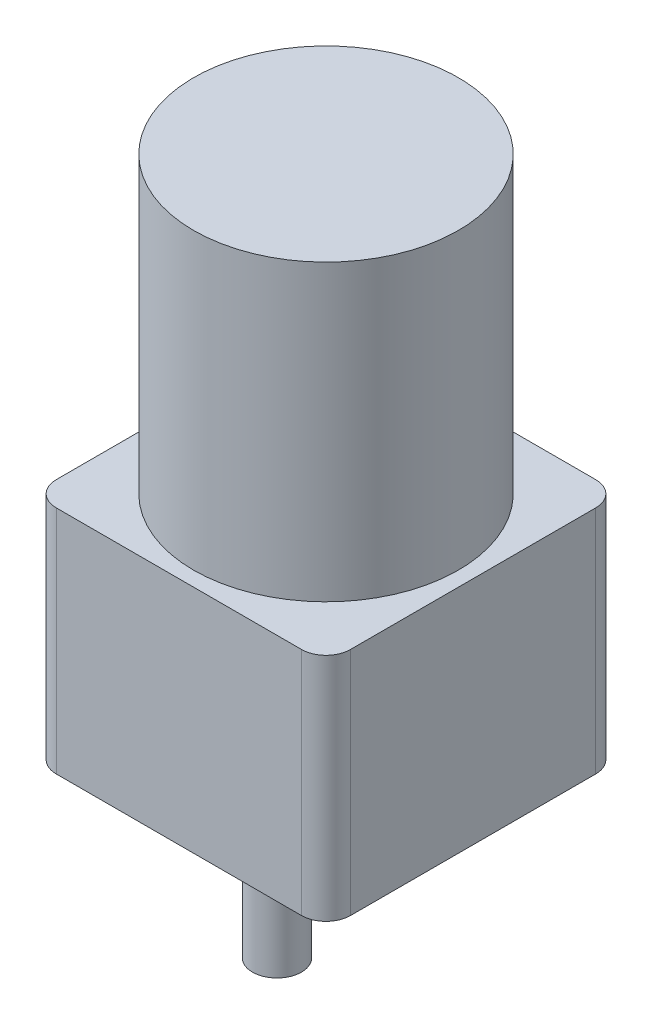
ISO-10303-21;
HEADER;
FILE_DESCRIPTION(('STEP AP214'),'2;1');
FILE_NAME('part.step','',(''),(''),'','','');
FILE_SCHEMA(('AUTOMOTIVE_DESIGN { 1 0 10303 214 1 1 1 1 }'));
ENDSEC;
DATA;
#1=APPLICATION_CONTEXT('core data for automotive mechanical design processes');
#2=APPLICATION_PROTOCOL_DEFINITION('international standard','automotive_design',2000,#1);
#3=PRODUCT_CONTEXT('',#1,'mechanical');
#4=PRODUCT('Part','Part','',(#3));
#5=PRODUCT_RELATED_PRODUCT_CATEGORY('part','',(#4));
#6=PRODUCT_DEFINITION_FORMATION('','',#4);
#7=PRODUCT_DEFINITION_CONTEXT('part definition',#1,'design');
#8=PRODUCT_DEFINITION('design','',#6,#7);
#9=PRODUCT_DEFINITION_SHAPE('','',#8);
#10=(LENGTH_UNIT() NAMED_UNIT(*) SI_UNIT(.MILLI.,.METRE.));
#11=(NAMED_UNIT(*) PLANE_ANGLE_UNIT() SI_UNIT($,.RADIAN.));
#12=(NAMED_UNIT(*) SI_UNIT($,.STERADIAN.) SOLID_ANGLE_UNIT());
#13=UNCERTAINTY_MEASURE_WITH_UNIT(LENGTH_MEASURE(1.E-05),#10,'distance_accuracy_value','');
#14=(GEOMETRIC_REPRESENTATION_CONTEXT(3) GLOBAL_UNCERTAINTY_ASSIGNED_CONTEXT((#13)) GLOBAL_UNIT_ASSIGNED_CONTEXT((#10,
#11,#12)) REPRESENTATION_CONTEXT('',''));
#15=CARTESIAN_POINT('',(0.,0.,0.));
#16=DIRECTION('',(0.,0.,1.));
#17=DIRECTION('',(1.,0.,0.));
#18=AXIS2_PLACEMENT_3D('',#15,#16,#17);
#19=CARTESIAN_POINT('',(30.,47.,-30.));
#20=DIRECTION('',(-1.,0.,0.));
#21=DIRECTION('',(0.,0.,1.));
#22=AXIS2_PLACEMENT_3D('',#19,#20,#21);
#23=PLANE('',#22);
#24=DIRECTION('',(0.,0.,-1.));
#25=VECTOR('',#24,1.);
#26=CARTESIAN_POINT('',(30.,0.,-30.));
#27=LINE('',#26,#25);
#28=CARTESIAN_POINT('',(30.,0.,25.));
#29=VERTEX_POINT('',#28);
#30=CARTESIAN_POINT('',(30.,0.,-25.));
#31=VERTEX_POINT('',#30);
#32=EDGE_CURVE('E145',#29,#31,#27,.T.);
#33=ORIENTED_EDGE('',*,*,#32,.T.);
#34=DIRECTION('',(0.,-1.,0.));
#35=VECTOR('',#34,1.);
#36=CARTESIAN_POINT('',(30.,47.,-25.));
#37=LINE('',#36,#35);
#38=CARTESIAN_POINT('',(30.,47.,-25.));
#39=VERTEX_POINT('',#38);
#40=EDGE_CURVE('E179',#31,#39,#37,.F.);
#41=ORIENTED_EDGE('',*,*,#40,.T.);
#42=DIRECTION('',(0.,0.,-1.));
#43=VECTOR('',#42,1.);
#44=CARTESIAN_POINT('',(30.,47.,-30.));
#45=LINE('',#44,#43);
#46=CARTESIAN_POINT('',(30.,47.,25.));
#47=VERTEX_POINT('',#46);
#48=EDGE_CURVE('E143',#47,#39,#45,.T.);
#49=ORIENTED_EDGE('',*,*,#48,.F.);
#50=DIRECTION('',(0.,-1.,0.));
#51=VECTOR('',#50,1.);
#52=CARTESIAN_POINT('',(30.,47.,25.));
#53=LINE('',#52,#51);
#54=EDGE_CURVE('E175',#47,#29,#53,.T.);
#55=ORIENTED_EDGE('',*,*,#54,.T.);
#56=EDGE_LOOP('',(#33,#41,#49,#55));
#57=FACE_BOUND('',#56,.T.);
#58=ADVANCED_FACE('F42',(#57),#23,.F.);
#59=CARTESIAN_POINT('',(-30.,47.,-30.));
#60=DIRECTION('',(0.,0.,1.));
#61=DIRECTION('',(1.,0.,0.));
#62=AXIS2_PLACEMENT_3D('',#59,#60,#61);
#63=PLANE('',#62);
#64=DIRECTION('',(-1.,0.,0.));
#65=VECTOR('',#64,1.);
#66=CARTESIAN_POINT('',(-30.,0.,-30.));
#67=LINE('',#66,#65);
#68=CARTESIAN_POINT('',(25.,0.,-30.));
#69=VERTEX_POINT('',#68);
#70=CARTESIAN_POINT('',(-25.,0.,-30.));
#71=VERTEX_POINT('',#70);
#72=EDGE_CURVE('E139',#69,#71,#67,.T.);
#73=ORIENTED_EDGE('',*,*,#72,.T.);
#74=DIRECTION('',(0.,-1.,0.));
#75=VECTOR('',#74,1.);
#76=CARTESIAN_POINT('',(-25.,47.,-30.));
#77=LINE('',#76,#75);
#78=CARTESIAN_POINT('',(-25.,47.,-30.));
#79=VERTEX_POINT('',#78);
#80=EDGE_CURVE('E115',#71,#79,#77,.F.);
#81=ORIENTED_EDGE('',*,*,#80,.T.);
#82=DIRECTION('',(-1.,0.,0.));
#83=VECTOR('',#82,1.);
#84=CARTESIAN_POINT('',(-30.,47.,-30.));
#85=LINE('',#84,#83);
#86=CARTESIAN_POINT('',(25.,47.,-30.));
#87=VERTEX_POINT('',#86);
#88=EDGE_CURVE('E198',#87,#79,#85,.T.);
#89=ORIENTED_EDGE('',*,*,#88,.F.);
#90=DIRECTION('',(0.,-1.,0.));
#91=VECTOR('',#90,1.);
#92=CARTESIAN_POINT('',(25.,47.,-30.));
#93=LINE('',#92,#91);
#94=EDGE_CURVE('E121',#87,#69,#93,.T.);
#95=ORIENTED_EDGE('',*,*,#94,.T.);
#96=EDGE_LOOP('',(#73,#81,#89,#95));
#97=FACE_BOUND('',#96,.T.);
#98=ADVANCED_FACE('F242',(#97),#63,.F.);
#99=CARTESIAN_POINT('',(-30.,47.,-30.));
#100=DIRECTION('',(1.,0.,0.));
#101=DIRECTION('',(0.,0.,-1.));
#102=AXIS2_PLACEMENT_3D('',#99,#100,#101);
#103=PLANE('',#102);
#104=DIRECTION('',(0.,0.,1.));
#105=VECTOR('',#104,1.);
#106=CARTESIAN_POINT('',(-30.,47.,-30.));
#107=LINE('',#106,#105);
#108=CARTESIAN_POINT('',(-30.,47.,-25.));
#109=VERTEX_POINT('',#108);
#110=CARTESIAN_POINT('',(-30.,47.,25.));
#111=VERTEX_POINT('',#110);
#112=EDGE_CURVE('E130',#109,#111,#107,.T.);
#113=ORIENTED_EDGE('',*,*,#112,.F.);
#114=DIRECTION('',(0.,-1.,0.));
#115=VECTOR('',#114,1.);
#116=CARTESIAN_POINT('',(-30.,47.,-25.));
#117=LINE('',#116,#115);
#118=CARTESIAN_POINT('',(-30.,0.,-25.));
#119=VERTEX_POINT('',#118);
#120=EDGE_CURVE('E114',#109,#119,#117,.T.);
#121=ORIENTED_EDGE('',*,*,#120,.T.);
#122=DIRECTION('',(0.,0.,1.));
#123=VECTOR('',#122,1.);
#124=CARTESIAN_POINT('',(-30.,0.,-30.));
#125=LINE('',#124,#123);
#126=CARTESIAN_POINT('',(-30.,0.,25.));
#127=VERTEX_POINT('',#126);
#128=EDGE_CURVE('E128',#119,#127,#125,.T.);
#129=ORIENTED_EDGE('',*,*,#128,.T.);
#130=DIRECTION('',(0.,-1.,0.));
#131=VECTOR('',#130,1.);
#132=CARTESIAN_POINT('',(-30.,47.,25.));
#133=LINE('',#132,#131);
#134=EDGE_CURVE('E133',#127,#111,#133,.F.);
#135=ORIENTED_EDGE('',*,*,#134,.T.);
#136=EDGE_LOOP('',(#113,#121,#129,#135));
#137=FACE_BOUND('',#136,.T.);
#138=ADVANCED_FACE('F127',(#137),#103,.F.);
#139=CARTESIAN_POINT('',(-30.,47.,30.));
#140=DIRECTION('',(0.,0.,-1.));
#141=DIRECTION('',(-1.,0.,0.));
#142=AXIS2_PLACEMENT_3D('',#139,#140,#141);
#143=PLANE('',#142);
#144=DIRECTION('',(1.,0.,0.));
#145=VECTOR('',#144,1.);
#146=CARTESIAN_POINT('',(-30.,0.,30.));
#147=LINE('',#146,#145);
#148=CARTESIAN_POINT('',(-25.,0.,30.));
#149=VERTEX_POINT('',#148);
#150=CARTESIAN_POINT('',(25.,0.,30.));
#151=VERTEX_POINT('',#150);
#152=EDGE_CURVE('E138',#149,#151,#147,.T.);
#153=ORIENTED_EDGE('',*,*,#152,.T.);
#154=DIRECTION('',(0.,-1.,0.));
#155=VECTOR('',#154,1.);
#156=CARTESIAN_POINT('',(25.,47.,30.));
#157=LINE('',#156,#155);
#158=CARTESIAN_POINT('',(25.,47.,30.));
#159=VERTEX_POINT('',#158);
#160=EDGE_CURVE('E58',#151,#159,#157,.F.);
#161=ORIENTED_EDGE('',*,*,#160,.T.);
#162=DIRECTION('',(1.,0.,0.));
#163=VECTOR('',#162,1.);
#164=CARTESIAN_POINT('',(-30.,47.,30.));
#165=LINE('',#164,#163);
#166=CARTESIAN_POINT('',(-25.,47.,30.));
#167=VERTEX_POINT('',#166);
#168=EDGE_CURVE('E150',#167,#159,#165,.T.);
#169=ORIENTED_EDGE('',*,*,#168,.F.);
#170=DIRECTION('',(0.,-1.,0.));
#171=VECTOR('',#170,1.);
#172=CARTESIAN_POINT('',(-25.,47.,30.));
#173=LINE('',#172,#171);
#174=EDGE_CURVE('E182',#167,#149,#173,.T.);
#175=ORIENTED_EDGE('',*,*,#174,.T.);
#176=EDGE_LOOP('',(#153,#161,#169,#175));
#177=FACE_BOUND('',#176,.T.);
#178=ADVANCED_FACE('F237',(#177),#143,.F.);
#179=CARTESIAN_POINT('',(0.,47.,0.));
#180=DIRECTION('',(0.,1.,0.));
#181=DIRECTION('',(0.,0.,1.));
#182=AXIS2_PLACEMENT_3D('',#179,#180,#181);
#183=PLANE('',#182);
#184=CARTESIAN_POINT('',(0.,47.,0.));
#185=DIRECTION('',(0.,1.,0.));
#186=DIRECTION('',(0.,0.,1.));
#187=AXIS2_PLACEMENT_3D('',#184,#185,#186);
#188=CIRCLE('',#187,27.);
#189=CARTESIAN_POINT('',(0.,47.,27.));
#190=VERTEX_POINT('',#189);
#191=EDGE_CURVE('E51',#190,#190,#188,.T.);
#192=ORIENTED_EDGE('',*,*,#191,.F.);
#193=EDGE_LOOP('',(#192));
#194=FACE_BOUND('',#193,.T.);
#195=ORIENTED_EDGE('',*,*,#88,.T.);
#196=CARTESIAN_POINT('',(-25.,47.,-25.));
#197=DIRECTION('',(0.,1.,0.));
#198=DIRECTION('',(0.,0.,1.));
#199=AXIS2_PLACEMENT_3D('',#196,#197,#198);
#200=CIRCLE('',#199,5.);
#201=EDGE_CURVE('E172',#79,#109,#200,.T.);
#202=ORIENTED_EDGE('',*,*,#201,.T.);
#203=ORIENTED_EDGE('',*,*,#112,.T.);
#204=CARTESIAN_POINT('',(-25.,47.,25.));
#205=DIRECTION('',(0.,1.,0.));
#206=DIRECTION('',(0.,0.,1.));
#207=AXIS2_PLACEMENT_3D('',#204,#205,#206);
#208=CIRCLE('',#207,5.);
#209=EDGE_CURVE('E65',#111,#167,#208,.T.);
#210=ORIENTED_EDGE('',*,*,#209,.T.);
#211=ORIENTED_EDGE('',*,*,#168,.T.);
#212=CARTESIAN_POINT('',(25.,47.,25.));
#213=DIRECTION('',(0.,1.,0.));
#214=DIRECTION('',(0.,0.,1.));
#215=AXIS2_PLACEMENT_3D('',#212,#213,#214);
#216=CIRCLE('',#215,5.);
#217=EDGE_CURVE('E166',#159,#47,#216,.T.);
#218=ORIENTED_EDGE('',*,*,#217,.T.);
#219=ORIENTED_EDGE('',*,*,#48,.T.);
#220=CARTESIAN_POINT('',(25.,47.,-25.));
#221=DIRECTION('',(0.,1.,0.));
#222=DIRECTION('',(0.,0.,1.));
#223=AXIS2_PLACEMENT_3D('',#220,#221,#222);
#224=CIRCLE('',#223,5.);
#225=EDGE_CURVE('E169',#39,#87,#224,.T.);
#226=ORIENTED_EDGE('',*,*,#225,.T.);
#227=EDGE_LOOP('',(#195,#202,#203,#210,#211,#218,#219,#226));
#228=FACE_BOUND('',#227,.T.);
#229=ADVANCED_FACE('F229',(#194,#228),#183,.T.);
#230=CARTESIAN_POINT('',(0.,0.,0.));
#231=DIRECTION('',(0.,1.,0.));
#232=DIRECTION('',(0.,0.,1.));
#233=AXIS2_PLACEMENT_3D('',#230,#231,#232);
#234=PLANE('',#233);
#235=CARTESIAN_POINT('',(0.,0.,9.99999999999999));
#236=DIRECTION('',(0.,1.,0.));
#237=DIRECTION('',(0.,0.,1.));
#238=AXIS2_PLACEMENT_3D('',#235,#236,#237);
#239=CIRCLE('',#238,5.);
#240=CARTESIAN_POINT('',(0.,0.,15.));
#241=VERTEX_POINT('',#240);
#242=EDGE_CURVE('E11',#241,#241,#239,.F.);
#243=ORIENTED_EDGE('',*,*,#242,.F.);
#244=EDGE_LOOP('',(#243));
#245=FACE_BOUND('',#244,.T.);
#246=ORIENTED_EDGE('',*,*,#128,.F.);
#247=CARTESIAN_POINT('',(-25.,0.,-25.));
#248=DIRECTION('',(0.,1.,0.));
#249=DIRECTION('',(0.,0.,1.));
#250=AXIS2_PLACEMENT_3D('',#247,#248,#249);
#251=CIRCLE('',#250,5.);
#252=EDGE_CURVE('E110',#119,#71,#251,.F.);
#253=ORIENTED_EDGE('',*,*,#252,.T.);
#254=ORIENTED_EDGE('',*,*,#72,.F.);
#255=CARTESIAN_POINT('',(25.,0.,-25.));
#256=DIRECTION('',(0.,1.,0.));
#257=DIRECTION('',(0.,0.,1.));
#258=AXIS2_PLACEMENT_3D('',#255,#256,#257);
#259=CIRCLE('',#258,5.);
#260=EDGE_CURVE('E122',#69,#31,#259,.F.);
#261=ORIENTED_EDGE('',*,*,#260,.T.);
#262=ORIENTED_EDGE('',*,*,#32,.F.);
#263=CARTESIAN_POINT('',(25.,0.,25.));
#264=DIRECTION('',(0.,1.,0.));
#265=DIRECTION('',(0.,0.,1.));
#266=AXIS2_PLACEMENT_3D('',#263,#264,#265);
#267=CIRCLE('',#266,5.);
#268=EDGE_CURVE('E154',#29,#151,#267,.F.);
#269=ORIENTED_EDGE('',*,*,#268,.T.);
#270=ORIENTED_EDGE('',*,*,#152,.F.);
#271=CARTESIAN_POINT('',(-25.,0.,25.));
#272=DIRECTION('',(0.,1.,0.));
#273=DIRECTION('',(0.,0.,1.));
#274=AXIS2_PLACEMENT_3D('',#271,#272,#273);
#275=CIRCLE('',#274,5.);
#276=EDGE_CURVE('E132',#149,#127,#275,.F.);
#277=ORIENTED_EDGE('',*,*,#276,.T.);
#278=EDGE_LOOP('',(#246,#253,#254,#261,#262,#269,#270,#277));
#279=FACE_BOUND('',#278,.T.);
#280=ADVANCED_FACE('F135',(#245,#279),#234,.F.);
#281=CARTESIAN_POINT('',(-25.,47.,-25.));
#282=DIRECTION('',(0.,-1.,0.));
#283=DIRECTION('',(0.,0.,-1.));
#284=AXIS2_PLACEMENT_3D('',#281,#282,#283);
#285=CYLINDRICAL_SURFACE('',#284,5.);
#286=ORIENTED_EDGE('',*,*,#201,.F.);
#287=ORIENTED_EDGE('',*,*,#80,.F.);
#288=ORIENTED_EDGE('',*,*,#252,.F.);
#289=ORIENTED_EDGE('',*,*,#120,.F.);
#290=EDGE_LOOP('',(#286,#287,#288,#289));
#291=FACE_BOUND('',#290,.T.);
#292=ADVANCED_FACE('F113',(#291),#285,.T.);
#293=CARTESIAN_POINT('',(25.,47.,-25.));
#294=DIRECTION('',(0.,-1.,0.));
#295=DIRECTION('',(0.,0.,-1.));
#296=AXIS2_PLACEMENT_3D('',#293,#294,#295);
#297=CYLINDRICAL_SURFACE('',#296,5.);
#298=ORIENTED_EDGE('',*,*,#225,.F.);
#299=ORIENTED_EDGE('',*,*,#40,.F.);
#300=ORIENTED_EDGE('',*,*,#260,.F.);
#301=ORIENTED_EDGE('',*,*,#94,.F.);
#302=EDGE_LOOP('',(#298,#299,#300,#301));
#303=FACE_BOUND('',#302,.T.);
#304=ADVANCED_FACE('F235',(#303),#297,.T.);
#305=CARTESIAN_POINT('',(25.,47.,25.));
#306=DIRECTION('',(0.,-1.,0.));
#307=DIRECTION('',(0.,0.,-1.));
#308=AXIS2_PLACEMENT_3D('',#305,#306,#307);
#309=CYLINDRICAL_SURFACE('',#308,5.);
#310=ORIENTED_EDGE('',*,*,#217,.F.);
#311=ORIENTED_EDGE('',*,*,#160,.F.);
#312=ORIENTED_EDGE('',*,*,#268,.F.);
#313=ORIENTED_EDGE('',*,*,#54,.F.);
#314=EDGE_LOOP('',(#310,#311,#312,#313));
#315=FACE_BOUND('',#314,.T.);
#316=ADVANCED_FACE('F252',(#315),#309,.T.);
#317=CARTESIAN_POINT('',(-25.,47.,25.));
#318=DIRECTION('',(0.,-1.,0.));
#319=DIRECTION('',(0.,0.,-1.));
#320=AXIS2_PLACEMENT_3D('',#317,#318,#319);
#321=CYLINDRICAL_SURFACE('',#320,5.);
#322=ORIENTED_EDGE('',*,*,#209,.F.);
#323=ORIENTED_EDGE('',*,*,#134,.F.);
#324=ORIENTED_EDGE('',*,*,#276,.F.);
#325=ORIENTED_EDGE('',*,*,#174,.F.);
#326=EDGE_LOOP('',(#322,#323,#324,#325));
#327=FACE_BOUND('',#326,.T.);
#328=ADVANCED_FACE('F44',(#327),#321,.T.);
#329=CARTESIAN_POINT('',(0.,107.,0.));
#330=DIRECTION('',(0.,-1.,0.));
#331=DIRECTION('',(0.,0.,-1.));
#332=AXIS2_PLACEMENT_3D('',#329,#330,#331);
#333=CYLINDRICAL_SURFACE('',#332,27.);
#334=CARTESIAN_POINT('',(0.,107.,0.));
#335=DIRECTION('',(0.,1.,0.));
#336=DIRECTION('',(0.,0.,1.));
#337=AXIS2_PLACEMENT_3D('',#334,#335,#336);
#338=CIRCLE('',#337,27.);
#339=CARTESIAN_POINT('',(0.,107.,27.));
#340=VERTEX_POINT('',#339);
#341=EDGE_CURVE('E193',#340,#340,#338,.T.);
#342=ORIENTED_EDGE('',*,*,#341,.F.);
#343=EDGE_LOOP('',(#342));
#344=FACE_BOUND('',#343,.T.);
#345=ORIENTED_EDGE('',*,*,#191,.T.);
#346=EDGE_LOOP('',(#345));
#347=FACE_BOUND('',#346,.T.);
#348=ADVANCED_FACE('F259',(#344,#347),#333,.T.);
#349=CARTESIAN_POINT('',(0.,107.,0.));
#350=DIRECTION('',(0.,1.,0.));
#351=DIRECTION('',(0.,0.,1.));
#352=AXIS2_PLACEMENT_3D('',#349,#350,#351);
#353=PLANE('',#352);
#354=ORIENTED_EDGE('',*,*,#341,.T.);
#355=EDGE_LOOP('',(#354));
#356=FACE_BOUND('',#355,.T.);
#357=ADVANCED_FACE('F224',(#356),#353,.T.);
#358=CARTESIAN_POINT('',(0.,-30.,9.99999999999999));
#359=DIRECTION('',(0.,1.,0.));
#360=DIRECTION('',(0.,0.,1.));
#361=AXIS2_PLACEMENT_3D('',#358,#359,#360);
#362=CYLINDRICAL_SURFACE('',#361,5.);
#363=CARTESIAN_POINT('',(0.,-30.,9.99999999999999));
#364=DIRECTION('',(0.,-1.,0.));
#365=DIRECTION('',(0.,0.,-1.));
#366=AXIS2_PLACEMENT_3D('',#363,#364,#365);
#367=CIRCLE('',#366,5.);
#368=CARTESIAN_POINT('',(0.,-30.,4.99999999999999));
#369=VERTEX_POINT('',#368);
#370=EDGE_CURVE('E212',#369,#369,#367,.T.);
#371=ORIENTED_EDGE('',*,*,#370,.F.);
#372=EDGE_LOOP('',(#371));
#373=FACE_BOUND('',#372,.T.);
#374=ORIENTED_EDGE('',*,*,#242,.T.);
#375=EDGE_LOOP('',(#374));
#376=FACE_BOUND('',#375,.T.);
#377=ADVANCED_FACE('F221',(#373,#376),#362,.T.);
#378=CARTESIAN_POINT('',(0.,-30.,9.99999999999999));
#379=DIRECTION('',(0.,-1.,0.));
#380=DIRECTION('',(0.,0.,-1.));
#381=AXIS2_PLACEMENT_3D('',#378,#379,#380);
#382=PLANE('',#381);
#383=ORIENTED_EDGE('',*,*,#370,.T.);
#384=EDGE_LOOP('',(#383));
#385=FACE_BOUND('',#384,.T.);
#386=ADVANCED_FACE('F219',(#385),#382,.T.);
#387=CLOSED_SHELL('',(#58,#98,#138,#178,#229,#280,#292,#304,#316,#328,#348,#357,#377,#386));
#388=MANIFOLD_SOLID_BREP('B2',#387);
#389=ADVANCED_BREP_SHAPE_REPRESENTATION('',(#18,#388),#14);
#390=SHAPE_DEFINITION_REPRESENTATION(#9,#389);
ENDSEC;
END-ISO-10303-21;
